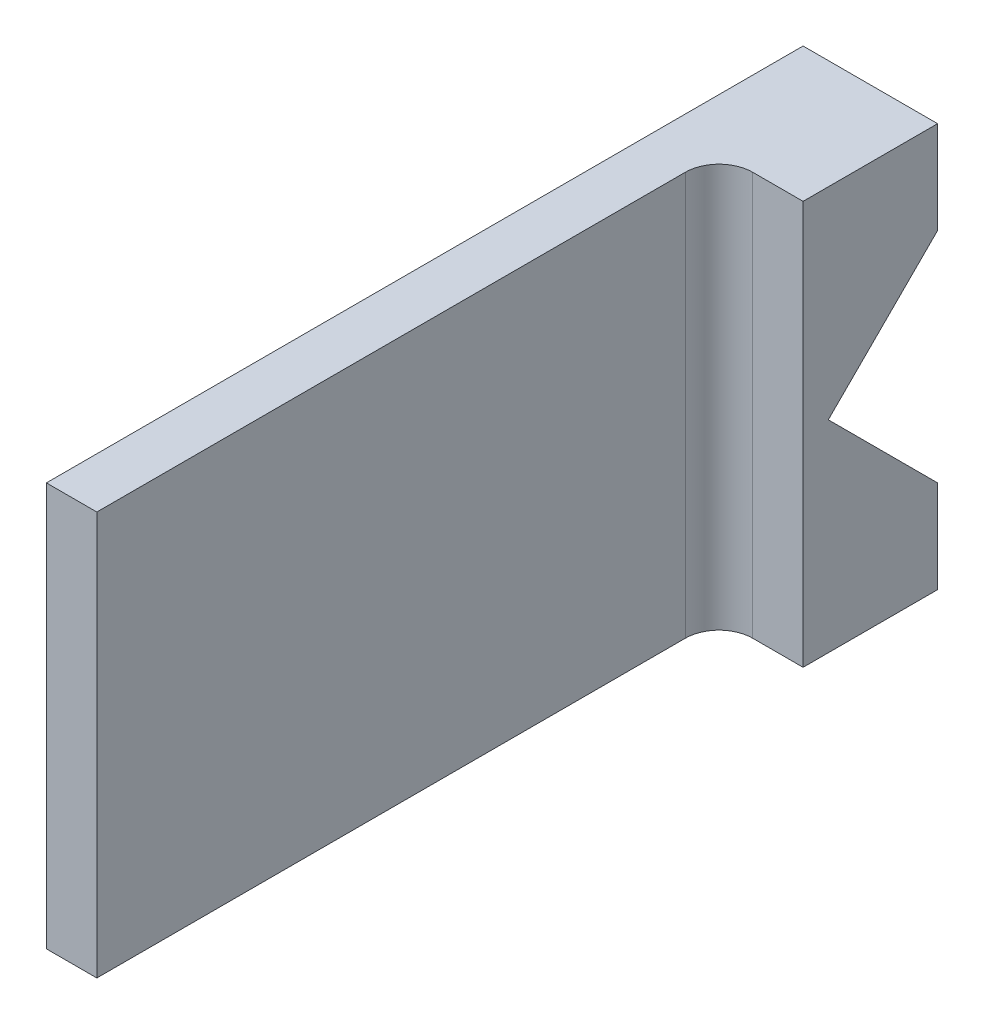
ISO-10303-21;
HEADER;
FILE_DESCRIPTION(('STEP AP214'),'2;1');
FILE_NAME('part.step','',(''),(''),'','','');
FILE_SCHEMA(('AUTOMOTIVE_DESIGN { 1 0 10303 214 1 1 1 1 }'));
ENDSEC;
DATA;
#1=APPLICATION_CONTEXT('core data for automotive mechanical design processes');
#2=APPLICATION_PROTOCOL_DEFINITION('international standard','automotive_design',2000,#1);
#3=PRODUCT_CONTEXT('',#1,'mechanical');
#4=PRODUCT('Part','Part','',(#3));
#5=PRODUCT_RELATED_PRODUCT_CATEGORY('part','',(#4));
#6=PRODUCT_DEFINITION_FORMATION('','',#4);
#7=PRODUCT_DEFINITION_CONTEXT('part definition',#1,'design');
#8=PRODUCT_DEFINITION('design','',#6,#7);
#9=PRODUCT_DEFINITION_SHAPE('','',#8);
#10=(LENGTH_UNIT() NAMED_UNIT(*) SI_UNIT(.MILLI.,.METRE.));
#11=(NAMED_UNIT(*) PLANE_ANGLE_UNIT() SI_UNIT($,.RADIAN.));
#12=(NAMED_UNIT(*) SI_UNIT($,.STERADIAN.) SOLID_ANGLE_UNIT());
#13=UNCERTAINTY_MEASURE_WITH_UNIT(LENGTH_MEASURE(1.E-05),#10,'distance_accuracy_value','');
#14=(GEOMETRIC_REPRESENTATION_CONTEXT(3) GLOBAL_UNCERTAINTY_ASSIGNED_CONTEXT((#13)) GLOBAL_UNIT_ASSIGNED_CONTEXT((#10,
#11,#12)) REPRESENTATION_CONTEXT('',''));
#15=CARTESIAN_POINT('',(0.,0.,0.));
#16=DIRECTION('',(0.,0.,1.));
#17=DIRECTION('',(1.,0.,0.));
#18=AXIS2_PLACEMENT_3D('',#15,#16,#17);
#19=CARTESIAN_POINT('',(12.7,0.,10.31875));
#20=DIRECTION('',(0.,0.707106781186547,0.707106781186548));
#21=DIRECTION('',(0.,-0.707106781186548,0.707106781186547));
#22=AXIS2_PLACEMENT_3D('',#19,#20,#21);
#23=PLANE('',#22);
#24=DIRECTION('',(0.,0.707106781186548,-0.707106781186547));
#25=VECTOR('',#24,1.);
#26=CARTESIAN_POINT('',(0.,0.,10.31875));
#27=LINE('',#26,#25);
#28=CARTESIAN_POINT('',(0.,0.,10.31875));
#29=VERTEX_POINT('',#28);
#30=CARTESIAN_POINT('',(0.,10.31875,0.));
#31=VERTEX_POINT('',#30);
#32=EDGE_CURVE('E127',#29,#31,#27,.T.);
#33=ORIENTED_EDGE('',*,*,#32,.T.);
#34=DIRECTION('',(-1.,0.,0.));
#35=VECTOR('',#34,1.);
#36=CARTESIAN_POINT('',(12.7,10.31875,0.));
#37=LINE('',#36,#35);
#38=CARTESIAN_POINT('',(12.7,10.31875,0.));
#39=VERTEX_POINT('',#38);
#40=EDGE_CURVE('E145',#39,#31,#37,.T.);
#41=ORIENTED_EDGE('',*,*,#40,.F.);
#42=DIRECTION('',(0.,0.707106781186548,-0.707106781186547));
#43=VECTOR('',#42,1.);
#44=CARTESIAN_POINT('',(12.7,0.,10.31875));
#45=LINE('',#44,#43);
#46=CARTESIAN_POINT('',(12.7,0.,10.31875));
#47=VERTEX_POINT('',#46);
#48=EDGE_CURVE('E159',#47,#39,#45,.T.);
#49=ORIENTED_EDGE('',*,*,#48,.F.);
#50=DIRECTION('',(-1.,0.,0.));
#51=VECTOR('',#50,1.);
#52=CARTESIAN_POINT('',(12.7,0.,10.31875));
#53=LINE('',#52,#51);
#54=EDGE_CURVE('E174',#47,#29,#53,.T.);
#55=ORIENTED_EDGE('',*,*,#54,.T.);
#56=EDGE_LOOP('',(#33,#41,#49,#55));
#57=FACE_BOUND('',#56,.T.);
#58=ADVANCED_FACE('F33',(#57),#23,.F.);
#59=CARTESIAN_POINT('',(12.7,19.05,0.));
#60=DIRECTION('',(0.,0.,1.));
#61=DIRECTION('',(0.,-1.,0.));
#62=AXIS2_PLACEMENT_3D('',#59,#60,#61);
#63=PLANE('',#62);
#64=DIRECTION('',(0.,1.,0.));
#65=VECTOR('',#64,1.);
#66=CARTESIAN_POINT('',(0.,19.05,0.));
#67=LINE('',#66,#65);
#68=CARTESIAN_POINT('',(0.,19.05,0.));
#69=VERTEX_POINT('',#68);
#70=EDGE_CURVE('E177',#31,#69,#67,.T.);
#71=ORIENTED_EDGE('',*,*,#70,.T.);
#72=DIRECTION('',(-1.,0.,0.));
#73=VECTOR('',#72,1.);
#74=CARTESIAN_POINT('',(12.7,19.05,0.));
#75=LINE('',#74,#73);
#76=CARTESIAN_POINT('',(12.7,19.05,0.));
#77=VERTEX_POINT('',#76);
#78=EDGE_CURVE('E136',#77,#69,#75,.T.);
#79=ORIENTED_EDGE('',*,*,#78,.F.);
#80=DIRECTION('',(0.,1.,0.));
#81=VECTOR('',#80,1.);
#82=CARTESIAN_POINT('',(12.7,19.05,0.));
#83=LINE('',#82,#81);
#84=EDGE_CURVE('E162',#39,#77,#83,.T.);
#85=ORIENTED_EDGE('',*,*,#84,.F.);
#86=ORIENTED_EDGE('',*,*,#40,.T.);
#87=EDGE_LOOP('',(#71,#79,#85,#86));
#88=FACE_BOUND('',#87,.T.);
#89=ADVANCED_FACE('F214',(#88),#63,.F.);
#90=CARTESIAN_POINT('',(12.7,19.05,71.4375));
#91=DIRECTION('',(0.,-1.,0.));
#92=DIRECTION('',(0.,0.,-1.));
#93=AXIS2_PLACEMENT_3D('',#90,#91,#92);
#94=PLANE('',#93);
#95=DIRECTION('',(-1.,0.,0.));
#96=VECTOR('',#95,1.);
#97=CARTESIAN_POINT('',(12.7,19.05,71.4375));
#98=LINE('',#97,#96);
#99=CARTESIAN_POINT('',(4.76250000000001,19.05,71.4375));
#100=VERTEX_POINT('',#99);
#101=CARTESIAN_POINT('',(0.,19.05,71.4375));
#102=VERTEX_POINT('',#101);
#103=EDGE_CURVE('E133',#100,#102,#98,.T.);
#104=ORIENTED_EDGE('',*,*,#103,.F.);
#105=DIRECTION('',(0.,0.,1.));
#106=VECTOR('',#105,1.);
#107=CARTESIAN_POINT('',(4.7625,19.05,12.7));
#108=LINE('',#107,#106);
#109=CARTESIAN_POINT('',(4.7625,19.05,15.875));
#110=VERTEX_POINT('',#109);
#111=EDGE_CURVE('E124',#110,#100,#108,.T.);
#112=ORIENTED_EDGE('',*,*,#111,.F.);
#113=CARTESIAN_POINT('',(7.9375,19.05,15.875));
#114=DIRECTION('',(0.,-1.,0.));
#115=DIRECTION('',(0.,0.,-1.));
#116=AXIS2_PLACEMENT_3D('',#113,#114,#115);
#117=CIRCLE('',#116,3.175);
#118=CARTESIAN_POINT('',(7.9375,19.05,12.7));
#119=VERTEX_POINT('',#118);
#120=EDGE_CURVE('E41',#110,#119,#117,.T.);
#121=ORIENTED_EDGE('',*,*,#120,.T.);
#122=DIRECTION('',(-1.,0.,0.));
#123=VECTOR('',#122,1.);
#124=CARTESIAN_POINT('',(12.7,19.05,12.7));
#125=LINE('',#124,#123);
#126=CARTESIAN_POINT('',(12.7,19.05,12.7));
#127=VERTEX_POINT('',#126);
#128=EDGE_CURVE('E153',#127,#119,#125,.T.);
#129=ORIENTED_EDGE('',*,*,#128,.F.);
#130=DIRECTION('',(0.,0.,1.));
#131=VECTOR('',#130,1.);
#132=CARTESIAN_POINT('',(12.7,19.05,71.4375));
#133=LINE('',#132,#131);
#134=EDGE_CURVE('E165',#77,#127,#133,.T.);
#135=ORIENTED_EDGE('',*,*,#134,.F.);
#136=ORIENTED_EDGE('',*,*,#78,.T.);
#137=DIRECTION('',(0.,0.,1.));
#138=VECTOR('',#137,1.);
#139=CARTESIAN_POINT('',(0.,19.05,71.4375));
#140=LINE('',#139,#138);
#141=EDGE_CURVE('E179',#69,#102,#140,.T.);
#142=ORIENTED_EDGE('',*,*,#141,.T.);
#143=EDGE_LOOP('',(#104,#112,#121,#129,#135,#136,#142));
#144=FACE_BOUND('',#143,.T.);
#145=ADVANCED_FACE('F151',(#144),#94,.F.);
#146=CARTESIAN_POINT('',(12.7,-19.05,71.4375));
#147=DIRECTION('',(0.,0.,-1.));
#148=DIRECTION('',(-1.,0.,0.));
#149=AXIS2_PLACEMENT_3D('',#146,#147,#148);
#150=PLANE('',#149);
#151=DIRECTION('',(-1.,0.,0.));
#152=VECTOR('',#151,1.);
#153=CARTESIAN_POINT('',(12.7,-19.05,71.4375));
#154=LINE('',#153,#152);
#155=CARTESIAN_POINT('',(4.76250000000001,-19.05,71.4375));
#156=VERTEX_POINT('',#155);
#157=CARTESIAN_POINT('',(0.,-19.05,71.4375));
#158=VERTEX_POINT('',#157);
#159=EDGE_CURVE('E112',#156,#158,#154,.T.);
#160=ORIENTED_EDGE('',*,*,#159,.F.);
#161=DIRECTION('',(0.,1.,0.));
#162=VECTOR('',#161,1.);
#163=CARTESIAN_POINT('',(4.76250000000001,-19.05,71.4375));
#164=LINE('',#163,#162);
#165=EDGE_CURVE('E122',#156,#100,#164,.T.);
#166=ORIENTED_EDGE('',*,*,#165,.T.);
#167=ORIENTED_EDGE('',*,*,#103,.T.);
#168=DIRECTION('',(0.,-1.,0.));
#169=VECTOR('',#168,1.);
#170=CARTESIAN_POINT('',(0.,-19.05,71.4375));
#171=LINE('',#170,#169);
#172=EDGE_CURVE('E131',#102,#158,#171,.T.);
#173=ORIENTED_EDGE('',*,*,#172,.T.);
#174=EDGE_LOOP('',(#160,#166,#167,#173));
#175=FACE_BOUND('',#174,.T.);
#176=ADVANCED_FACE('F129',(#175),#150,.F.);
#177=CARTESIAN_POINT('',(12.7,-19.05,0.));
#178=DIRECTION('',(0.,1.,0.));
#179=DIRECTION('',(0.,0.,1.));
#180=AXIS2_PLACEMENT_3D('',#177,#178,#179);
#181=PLANE('',#180);
#182=DIRECTION('',(-1.,0.,0.));
#183=VECTOR('',#182,1.);
#184=CARTESIAN_POINT('',(12.7,-19.05,12.7));
#185=LINE('',#184,#183);
#186=CARTESIAN_POINT('',(12.7,-19.05,12.7));
#187=VERTEX_POINT('',#186);
#188=CARTESIAN_POINT('',(7.9375,-19.05,12.7));
#189=VERTEX_POINT('',#188);
#190=EDGE_CURVE('E119',#187,#189,#185,.T.);
#191=ORIENTED_EDGE('',*,*,#190,.T.);
#192=CARTESIAN_POINT('',(7.9375,-19.05,15.875));
#193=DIRECTION('',(0.,1.,0.));
#194=DIRECTION('',(0.,0.,1.));
#195=AXIS2_PLACEMENT_3D('',#192,#193,#194);
#196=CIRCLE('',#195,3.175);
#197=CARTESIAN_POINT('',(4.7625,-19.05,15.875));
#198=VERTEX_POINT('',#197);
#199=EDGE_CURVE('E11',#189,#198,#196,.T.);
#200=ORIENTED_EDGE('',*,*,#199,.T.);
#201=DIRECTION('',(0.,0.,1.));
#202=VECTOR('',#201,1.);
#203=CARTESIAN_POINT('',(4.7625,-19.05,12.7));
#204=LINE('',#203,#202);
#205=EDGE_CURVE('E108',#198,#156,#204,.T.);
#206=ORIENTED_EDGE('',*,*,#205,.T.);
#207=ORIENTED_EDGE('',*,*,#159,.T.);
#208=DIRECTION('',(0.,0.,-1.));
#209=VECTOR('',#208,1.);
#210=CARTESIAN_POINT('',(0.,-19.05,0.));
#211=LINE('',#210,#209);
#212=CARTESIAN_POINT('',(0.,-19.05,0.));
#213=VERTEX_POINT('',#212);
#214=EDGE_CURVE('E182',#158,#213,#211,.T.);
#215=ORIENTED_EDGE('',*,*,#214,.T.);
#216=DIRECTION('',(-1.,0.,0.));
#217=VECTOR('',#216,1.);
#218=CARTESIAN_POINT('',(12.7,-19.05,0.));
#219=LINE('',#218,#217);
#220=CARTESIAN_POINT('',(12.7,-19.05,0.));
#221=VERTEX_POINT('',#220);
#222=EDGE_CURVE('E134',#221,#213,#219,.T.);
#223=ORIENTED_EDGE('',*,*,#222,.F.);
#224=DIRECTION('',(0.,0.,-1.));
#225=VECTOR('',#224,1.);
#226=CARTESIAN_POINT('',(12.7,-19.05,0.));
#227=LINE('',#226,#225);
#228=EDGE_CURVE('E168',#187,#221,#227,.T.);
#229=ORIENTED_EDGE('',*,*,#228,.F.);
#230=EDGE_LOOP('',(#191,#200,#206,#207,#215,#223,#229));
#231=FACE_BOUND('',#230,.T.);
#232=ADVANCED_FACE('F110',(#231),#181,.F.);
#233=CARTESIAN_POINT('',(12.7,-10.31875,0.));
#234=DIRECTION('',(0.,0.,1.));
#235=DIRECTION('',(0.,-1.,0.));
#236=AXIS2_PLACEMENT_3D('',#233,#234,#235);
#237=PLANE('',#236);
#238=DIRECTION('',(0.,1.,0.));
#239=VECTOR('',#238,1.);
#240=CARTESIAN_POINT('',(0.,-10.31875,0.));
#241=LINE('',#240,#239);
#242=CARTESIAN_POINT('',(0.,-10.31875,0.));
#243=VERTEX_POINT('',#242);
#244=EDGE_CURVE('E184',#213,#243,#241,.T.);
#245=ORIENTED_EDGE('',*,*,#244,.T.);
#246=DIRECTION('',(-1.,0.,0.));
#247=VECTOR('',#246,1.);
#248=CARTESIAN_POINT('',(12.7,-10.31875,0.));
#249=LINE('',#248,#247);
#250=CARTESIAN_POINT('',(12.7,-10.31875,0.));
#251=VERTEX_POINT('',#250);
#252=EDGE_CURVE('E139',#251,#243,#249,.T.);
#253=ORIENTED_EDGE('',*,*,#252,.F.);
#254=DIRECTION('',(0.,1.,0.));
#255=VECTOR('',#254,1.);
#256=CARTESIAN_POINT('',(12.7,-10.31875,0.));
#257=LINE('',#256,#255);
#258=EDGE_CURVE('E170',#221,#251,#257,.T.);
#259=ORIENTED_EDGE('',*,*,#258,.F.);
#260=ORIENTED_EDGE('',*,*,#222,.T.);
#261=EDGE_LOOP('',(#245,#253,#259,#260));
#262=FACE_BOUND('',#261,.T.);
#263=ADVANCED_FACE('F211',(#262),#237,.F.);
#264=CARTESIAN_POINT('',(12.7,-10.31875,0.));
#265=DIRECTION('',(0.,-0.707106781186548,0.707106781186547));
#266=DIRECTION('',(0.,-0.707106781186547,-0.707106781186548));
#267=AXIS2_PLACEMENT_3D('',#264,#265,#266);
#268=PLANE('',#267);
#269=DIRECTION('',(0.,0.707106781186548,0.707106781186548));
#270=VECTOR('',#269,1.);
#271=CARTESIAN_POINT('',(0.,-10.31875,0.));
#272=LINE('',#271,#270);
#273=EDGE_CURVE('E163',#243,#29,#272,.T.);
#274=ORIENTED_EDGE('',*,*,#273,.T.);
#275=ORIENTED_EDGE('',*,*,#54,.F.);
#276=DIRECTION('',(0.,0.707106781186548,0.707106781186548));
#277=VECTOR('',#276,1.);
#278=CARTESIAN_POINT('',(12.7,-10.31875,0.));
#279=LINE('',#278,#277);
#280=EDGE_CURVE('E172',#251,#47,#279,.T.);
#281=ORIENTED_EDGE('',*,*,#280,.F.);
#282=ORIENTED_EDGE('',*,*,#252,.T.);
#283=EDGE_LOOP('',(#274,#275,#281,#282));
#284=FACE_BOUND('',#283,.T.);
#285=ADVANCED_FACE('F193',(#284),#268,.F.);
#286=CARTESIAN_POINT('',(12.7,0.,0.));
#287=DIRECTION('',(1.,0.,0.));
#288=DIRECTION('',(0.,0.,-1.));
#289=AXIS2_PLACEMENT_3D('',#286,#287,#288);
#290=PLANE('',#289);
#291=DIRECTION('',(0.,1.,0.));
#292=VECTOR('',#291,1.);
#293=CARTESIAN_POINT('',(12.7,-19.05,12.7));
#294=LINE('',#293,#292);
#295=EDGE_CURVE('E118',#187,#127,#294,.T.);
#296=ORIENTED_EDGE('',*,*,#295,.F.);
#297=ORIENTED_EDGE('',*,*,#228,.T.);
#298=ORIENTED_EDGE('',*,*,#258,.T.);
#299=ORIENTED_EDGE('',*,*,#280,.T.);
#300=ORIENTED_EDGE('',*,*,#48,.T.);
#301=ORIENTED_EDGE('',*,*,#84,.T.);
#302=ORIENTED_EDGE('',*,*,#134,.T.);
#303=EDGE_LOOP('',(#296,#297,#298,#299,#300,#301,#302));
#304=FACE_BOUND('',#303,.T.);
#305=ADVANCED_FACE('F207',(#304),#290,.T.);
#306=CARTESIAN_POINT('',(0.,0.,0.));
#307=DIRECTION('',(1.,0.,0.));
#308=DIRECTION('',(0.,0.,-1.));
#309=AXIS2_PLACEMENT_3D('',#306,#307,#308);
#310=PLANE('',#309);
#311=ORIENTED_EDGE('',*,*,#32,.F.);
#312=ORIENTED_EDGE('',*,*,#273,.F.);
#313=ORIENTED_EDGE('',*,*,#244,.F.);
#314=ORIENTED_EDGE('',*,*,#214,.F.);
#315=ORIENTED_EDGE('',*,*,#172,.F.);
#316=ORIENTED_EDGE('',*,*,#141,.F.);
#317=ORIENTED_EDGE('',*,*,#70,.F.);
#318=EDGE_LOOP('',(#311,#312,#313,#314,#315,#316,#317));
#319=FACE_BOUND('',#318,.T.);
#320=ADVANCED_FACE('F200',(#319),#310,.F.);
#321=CARTESIAN_POINT('',(4.7625,-19.05,12.7));
#322=DIRECTION('',(-1.,0.,0.));
#323=DIRECTION('',(0.,0.,1.));
#324=AXIS2_PLACEMENT_3D('',#321,#322,#323);
#325=PLANE('',#324);
#326=ORIENTED_EDGE('',*,*,#205,.F.);
#327=DIRECTION('',(0.,1.,0.));
#328=VECTOR('',#327,1.);
#329=CARTESIAN_POINT('',(4.7625,19.05,15.875));
#330=LINE('',#329,#328);
#331=EDGE_CURVE('E148',#198,#110,#330,.T.);
#332=ORIENTED_EDGE('',*,*,#331,.T.);
#333=ORIENTED_EDGE('',*,*,#111,.T.);
#334=ORIENTED_EDGE('',*,*,#165,.F.);
#335=EDGE_LOOP('',(#326,#332,#333,#334));
#336=FACE_BOUND('',#335,.T.);
#337=ADVANCED_FACE('F123',(#336),#325,.F.);
#338=CARTESIAN_POINT('',(12.7,-19.05,12.7));
#339=DIRECTION('',(0.,0.,-1.));
#340=DIRECTION('',(0.,1.,0.));
#341=AXIS2_PLACEMENT_3D('',#338,#339,#340);
#342=PLANE('',#341);
#343=ORIENTED_EDGE('',*,*,#128,.T.);
#344=DIRECTION('',(0.,1.,0.));
#345=VECTOR('',#344,1.);
#346=CARTESIAN_POINT('',(7.9375,-19.05,12.7));
#347=LINE('',#346,#345);
#348=EDGE_CURVE('E48',#119,#189,#347,.F.);
#349=ORIENTED_EDGE('',*,*,#348,.T.);
#350=ORIENTED_EDGE('',*,*,#190,.F.);
#351=ORIENTED_EDGE('',*,*,#295,.T.);
#352=EDGE_LOOP('',(#343,#349,#350,#351));
#353=FACE_BOUND('',#352,.T.);
#354=ADVANCED_FACE('F235',(#353),#342,.F.);
#355=CARTESIAN_POINT('',(7.9375,-19.05,15.875));
#356=DIRECTION('',(0.,-1.,0.));
#357=DIRECTION('',(0.,0.,-1.));
#358=AXIS2_PLACEMENT_3D('',#355,#356,#357);
#359=CYLINDRICAL_SURFACE('',#358,3.175);
#360=ORIENTED_EDGE('',*,*,#199,.F.);
#361=ORIENTED_EDGE('',*,*,#348,.F.);
#362=ORIENTED_EDGE('',*,*,#120,.F.);
#363=ORIENTED_EDGE('',*,*,#331,.F.);
#364=EDGE_LOOP('',(#360,#361,#362,#363));
#365=FACE_BOUND('',#364,.T.);
#366=ADVANCED_FACE('F35',(#365),#359,.F.);
#367=CLOSED_SHELL('',(#58,#89,#145,#176,#232,#263,#285,#305,#320,#337,#354,#366));
#368=MANIFOLD_SOLID_BREP('B2',#367);
#369=ADVANCED_BREP_SHAPE_REPRESENTATION('',(#18,#368),#14);
#370=SHAPE_DEFINITION_REPRESENTATION(#9,#369);
ENDSEC;
END-ISO-10303-21;
